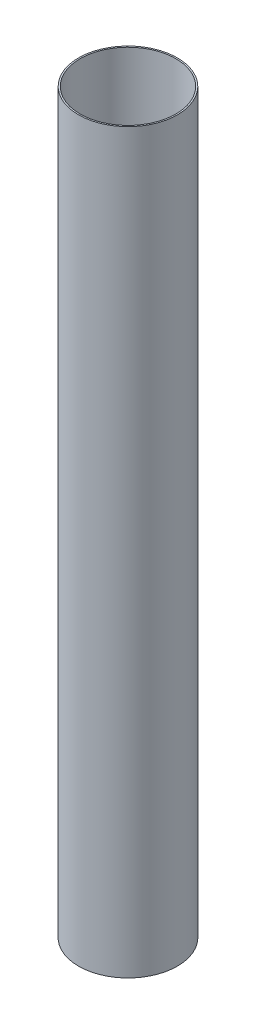
ISO-10303-21;
HEADER;
FILE_DESCRIPTION(('STEP AP214'),'2;1');
FILE_NAME('part.step','',(''),(''),'','','');
FILE_SCHEMA(('AUTOMOTIVE_DESIGN { 1 0 10303 214 1 1 1 1 }'));
ENDSEC;
DATA;
#1=APPLICATION_CONTEXT('core data for automotive mechanical design processes');
#2=APPLICATION_PROTOCOL_DEFINITION('international standard','automotive_design',2000,#1);
#3=PRODUCT_CONTEXT('',#1,'mechanical');
#4=PRODUCT('Part','Part','',(#3));
#5=PRODUCT_RELATED_PRODUCT_CATEGORY('part','',(#4));
#6=PRODUCT_DEFINITION_FORMATION('','',#4);
#7=PRODUCT_DEFINITION_CONTEXT('part definition',#1,'design');
#8=PRODUCT_DEFINITION('design','',#6,#7);
#9=PRODUCT_DEFINITION_SHAPE('','',#8);
#10=(LENGTH_UNIT() NAMED_UNIT(*) SI_UNIT(.MILLI.,.METRE.));
#11=(NAMED_UNIT(*) PLANE_ANGLE_UNIT() SI_UNIT($,.RADIAN.));
#12=(NAMED_UNIT(*) SI_UNIT($,.STERADIAN.) SOLID_ANGLE_UNIT());
#13=UNCERTAINTY_MEASURE_WITH_UNIT(LENGTH_MEASURE(1.E-05),#10,'distance_accuracy_value','');
#14=(GEOMETRIC_REPRESENTATION_CONTEXT(3) GLOBAL_UNCERTAINTY_ASSIGNED_CONTEXT((#13)) GLOBAL_UNIT_ASSIGNED_CONTEXT((#10,
#11,#12)) REPRESENTATION_CONTEXT('',''));
#15=CARTESIAN_POINT('',(0.,0.,0.));
#16=DIRECTION('',(0.,0.,1.));
#17=DIRECTION('',(1.,0.,0.));
#18=AXIS2_PLACEMENT_3D('',#15,#16,#17);
#19=CARTESIAN_POINT('',(0.,500.,0.));
#20=DIRECTION('',(0.,1.,0.));
#21=DIRECTION('',(0.,0.,1.));
#22=AXIS2_PLACEMENT_3D('',#19,#20,#21);
#23=PLANE('',#22);
#24=CARTESIAN_POINT('',(0.,500.,0.));
#25=DIRECTION('',(0.,1.,0.));
#26=DIRECTION('',(0.,0.,1.));
#27=AXIS2_PLACEMENT_3D('',#24,#25,#26);
#28=CIRCLE('',#27,67.);
#29=CARTESIAN_POINT('',(0.,500.,67.));
#30=VERTEX_POINT('',#29);
#31=EDGE_CURVE('E10',#30,#30,#28,.T.);
#32=ORIENTED_EDGE('',*,*,#31,.T.);
#33=EDGE_LOOP('',(#32));
#34=FACE_BOUND('',#33,.T.);
#35=CARTESIAN_POINT('',(0.,500.,0.));
#36=DIRECTION('',(0.,1.,0.));
#37=DIRECTION('',(0.,0.,1.));
#38=AXIS2_PLACEMENT_3D('',#35,#36,#37);
#39=CIRCLE('',#38,65.);
#40=CARTESIAN_POINT('',(0.,500.,65.));
#41=VERTEX_POINT('',#40);
#42=EDGE_CURVE('E42',#41,#41,#39,.T.);
#43=ORIENTED_EDGE('',*,*,#42,.F.);
#44=EDGE_LOOP('',(#43));
#45=FACE_BOUND('',#44,.T.);
#46=ADVANCED_FACE('F31',(#34,#45),#23,.T.);
#47=CARTESIAN_POINT('',(0.,-500.,0.));
#48=DIRECTION('',(0.,1.,0.));
#49=DIRECTION('',(0.,0.,1.));
#50=AXIS2_PLACEMENT_3D('',#47,#48,#49);
#51=PLANE('',#50);
#52=CARTESIAN_POINT('',(0.,-500.,0.));
#53=DIRECTION('',(0.,1.,0.));
#54=DIRECTION('',(0.,0.,1.));
#55=AXIS2_PLACEMENT_3D('',#52,#53,#54);
#56=CIRCLE('',#55,67.);
#57=CARTESIAN_POINT('',(0.,-500.,67.));
#58=VERTEX_POINT('',#57);
#59=EDGE_CURVE('E35',#58,#58,#56,.T.);
#60=ORIENTED_EDGE('',*,*,#59,.F.);
#61=EDGE_LOOP('',(#60));
#62=FACE_BOUND('',#61,.T.);
#63=CARTESIAN_POINT('',(0.,-500.,0.));
#64=DIRECTION('',(0.,1.,0.));
#65=DIRECTION('',(0.,0.,1.));
#66=AXIS2_PLACEMENT_3D('',#63,#64,#65);
#67=CIRCLE('',#66,65.);
#68=CARTESIAN_POINT('',(0.,-500.,65.));
#69=VERTEX_POINT('',#68);
#70=EDGE_CURVE('E44',#69,#69,#67,.T.);
#71=ORIENTED_EDGE('',*,*,#70,.T.);
#72=EDGE_LOOP('',(#71));
#73=FACE_BOUND('',#72,.T.);
#74=ADVANCED_FACE('F54',(#62,#73),#51,.F.);
#75=CARTESIAN_POINT('',(0.,500.,0.));
#76=DIRECTION('',(0.,-1.,0.));
#77=DIRECTION('',(0.,0.,-1.));
#78=AXIS2_PLACEMENT_3D('',#75,#76,#77);
#79=CYLINDRICAL_SURFACE('',#78,67.);
#80=ORIENTED_EDGE('',*,*,#31,.F.);
#81=EDGE_LOOP('',(#80));
#82=FACE_BOUND('',#81,.T.);
#83=ORIENTED_EDGE('',*,*,#59,.T.);
#84=EDGE_LOOP('',(#83));
#85=FACE_BOUND('',#84,.T.);
#86=ADVANCED_FACE('F33',(#82,#85),#79,.T.);
#87=CARTESIAN_POINT('',(0.,500.,0.));
#88=DIRECTION('',(0.,-1.,0.));
#89=DIRECTION('',(0.,0.,-1.));
#90=AXIS2_PLACEMENT_3D('',#87,#88,#89);
#91=CYLINDRICAL_SURFACE('',#90,65.);
#92=ORIENTED_EDGE('',*,*,#42,.T.);
#93=EDGE_LOOP('',(#92));
#94=FACE_BOUND('',#93,.T.);
#95=ORIENTED_EDGE('',*,*,#70,.F.);
#96=EDGE_LOOP('',(#95));
#97=FACE_BOUND('',#96,.T.);
#98=ADVANCED_FACE('F50',(#94,#97),#91,.F.);
#99=CLOSED_SHELL('',(#46,#74,#86,#98));
#100=MANIFOLD_SOLID_BREP('B2',#99);
#101=ADVANCED_BREP_SHAPE_REPRESENTATION('',(#18,#100),#14);
#102=SHAPE_DEFINITION_REPRESENTATION(#9,#101);
ENDSEC;
END-ISO-10303-21;
